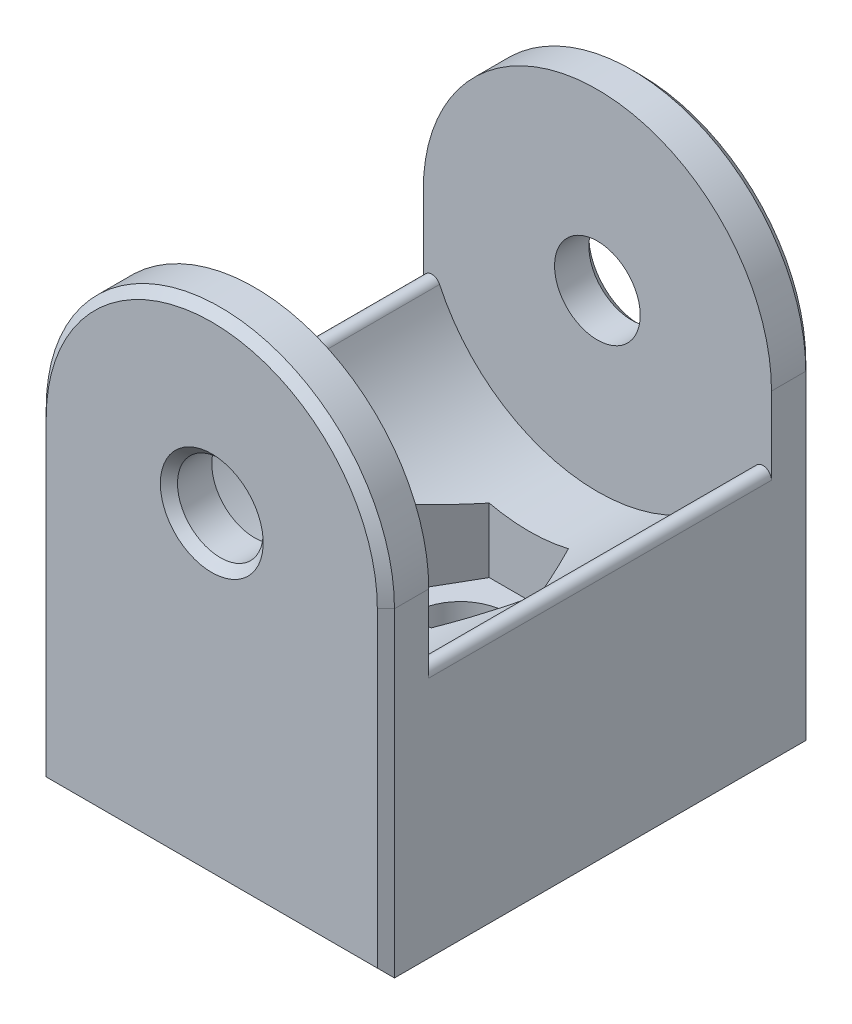
ISO-10303-21;
HEADER;
FILE_DESCRIPTION(('STEP AP214'),'2;1');
FILE_NAME('part.step','',(''),(''),'','','');
FILE_SCHEMA(('AUTOMOTIVE_DESIGN { 1 0 10303 214 1 1 1 1 }'));
ENDSEC;
DATA;
#1=APPLICATION_CONTEXT('core data for automotive mechanical design processes');
#2=APPLICATION_PROTOCOL_DEFINITION('international standard','automotive_design',2000,#1);
#3=PRODUCT_CONTEXT('',#1,'mechanical');
#4=PRODUCT('Part','Part','',(#3));
#5=PRODUCT_RELATED_PRODUCT_CATEGORY('part','',(#4));
#6=PRODUCT_DEFINITION_FORMATION('','',#4);
#7=PRODUCT_DEFINITION_CONTEXT('part definition',#1,'design');
#8=PRODUCT_DEFINITION('design','',#6,#7);
#9=PRODUCT_DEFINITION_SHAPE('','',#8);
#10=(LENGTH_UNIT() NAMED_UNIT(*) SI_UNIT(.MILLI.,.METRE.));
#11=(NAMED_UNIT(*) PLANE_ANGLE_UNIT() SI_UNIT($,.RADIAN.));
#12=(NAMED_UNIT(*) SI_UNIT($,.STERADIAN.) SOLID_ANGLE_UNIT());
#13=UNCERTAINTY_MEASURE_WITH_UNIT(LENGTH_MEASURE(1.E-05),#10,'distance_accuracy_value','');
#14=(GEOMETRIC_REPRESENTATION_CONTEXT(3) GLOBAL_UNCERTAINTY_ASSIGNED_CONTEXT((#13)) GLOBAL_UNIT_ASSIGNED_CONTEXT((#10,
#11,#12)) REPRESENTATION_CONTEXT('',''));
#15=CARTESIAN_POINT('',(0.,0.,0.));
#16=DIRECTION('',(0.,0.,1.));
#17=DIRECTION('',(1.,0.,0.));
#18=AXIS2_PLACEMENT_3D('',#15,#16,#17);
#19=CARTESIAN_POINT('',(0.,18.66,37.588004639698));
#20=DIRECTION('',(0.,0.,-1.));
#21=DIRECTION('',(-1.,0.,0.));
#22=AXIS2_PLACEMENT_3D('',#19,#20,#21);
#23=CYLINDRICAL_SURFACE('',#22,10.16);
#24=CARTESIAN_POINT('',(0.,18.66,10.));
#25=DIRECTION('',(0.,0.,1.));
#26=DIRECTION('',(0.,-1.,0.));
#27=AXIS2_PLACEMENT_3D('',#24,#25,#26);
#28=CIRCLE('',#27,10.16);
#29=CARTESIAN_POINT('',(9.206904315197,14.3636628471677,10.));
#30=VERTEX_POINT('',#29);
#31=CARTESIAN_POINT('',(-9.206904315197,14.3636628471677,10.));
#32=VERTEX_POINT('',#31);
#33=EDGE_CURVE('E226',#30,#32,#28,.F.);
#34=ORIENTED_EDGE('',*,*,#33,.F.);
#35=DIRECTION('',(0.,0.,-1.));
#36=VECTOR('',#35,1.);
#37=CARTESIAN_POINT('',(9.206904315197,14.3636628471677,37.588004639698));
#38=LINE('',#37,#36);
#39=CARTESIAN_POINT('',(9.206904315197,14.3636628471677,-10.));
#40=VERTEX_POINT('',#39);
#41=EDGE_CURVE('E257',#30,#40,#38,.T.);
#42=ORIENTED_EDGE('',*,*,#41,.T.);
#43=CARTESIAN_POINT('',(0.,18.66,-10.));
#44=DIRECTION('',(0.,0.,-1.));
#45=DIRECTION('',(-1.,0.,0.));
#46=AXIS2_PLACEMENT_3D('',#43,#44,#45);
#47=CIRCLE('',#46,10.16);
#48=CARTESIAN_POINT('',(-9.206904315197,14.3636628471677,-10.));
#49=VERTEX_POINT('',#48);
#50=EDGE_CURVE('E185',#40,#49,#47,.T.);
#51=ORIENTED_EDGE('',*,*,#50,.T.);
#52=DIRECTION('',(0.,0.,-1.));
#53=VECTOR('',#52,1.);
#54=CARTESIAN_POINT('',(-9.20690431519699,14.3636628471677,37.588004639698));
#55=LINE('',#54,#53);
#56=EDGE_CURVE('E253',#49,#32,#55,.F.);
#57=ORIENTED_EDGE('',*,*,#56,.T.);
#58=EDGE_LOOP('',(#34,#42,#51,#57));
#59=FACE_BOUND('',#58,.T.);
#60=CARTESIAN_POINT('',(0.,18.66,6.00000000000001));
#61=DIRECTION('',(-0.866025403784439,0.,-0.5));
#62=DIRECTION('',(0.5,0.,-0.866025403784439));
#63=AXIS2_PLACEMENT_3D('',#60,#61,#62);
#64=ELLIPSE('',#63,20.32,10.16);
#65=CARTESIAN_POINT('',(2.30940107675851,8.76594791469811,2.));
#66=VERTEX_POINT('',#65);
#67=CARTESIAN_POINT('',(4.61880215351701,9.61056539519365,-2.));
#68=VERTEX_POINT('',#67);
#69=EDGE_CURVE('E182',#66,#68,#64,.F.);
#70=ORIENTED_EDGE('',*,*,#69,.F.);
#71=CARTESIAN_POINT('',(0.,18.66,2.));
#72=DIRECTION('',(0.,0.,-1.));
#73=DIRECTION('',(-1.,0.,0.));
#74=AXIS2_PLACEMENT_3D('',#71,#72,#73);
#75=CIRCLE('',#74,10.16);
#76=CARTESIAN_POINT('',(-2.30940107675851,8.76594791469811,2.));
#77=VERTEX_POINT('',#76);
#78=EDGE_CURVE('E285',#77,#66,#75,.F.);
#79=ORIENTED_EDGE('',*,*,#78,.F.);
#80=CARTESIAN_POINT('',(0.,18.66,6.));
#81=DIRECTION('',(0.866025403784439,0.,-0.5));
#82=DIRECTION('',(-0.5,0.,-0.866025403784439));
#83=AXIS2_PLACEMENT_3D('',#80,#81,#82);
#84=ELLIPSE('',#83,20.32,10.16);
#85=CARTESIAN_POINT('',(-4.61880215351701,9.61056539519365,-2.));
#86=VERTEX_POINT('',#85);
#87=EDGE_CURVE('E287',#86,#77,#84,.F.);
#88=ORIENTED_EDGE('',*,*,#87,.F.);
#89=CARTESIAN_POINT('',(0.,18.66,-10.));
#90=DIRECTION('',(0.866025403784439,0.,0.5));
#91=DIRECTION('',(0.5,0.,-0.866025403784439));
#92=AXIS2_PLACEMENT_3D('',#89,#90,#91);
#93=ELLIPSE('',#92,20.32,10.16);
#94=CARTESIAN_POINT('',(-2.3094010767585,8.76594791469811,-6.));
#95=VERTEX_POINT('',#94);
#96=EDGE_CURVE('E290',#95,#86,#93,.F.);
#97=ORIENTED_EDGE('',*,*,#96,.F.);
#98=CARTESIAN_POINT('',(0.,18.66,-6.00000000000001));
#99=DIRECTION('',(0.,0.,1.));
#100=DIRECTION('',(1.,0.,0.));
#101=AXIS2_PLACEMENT_3D('',#98,#99,#100);
#102=CIRCLE('',#101,10.16);
#103=CARTESIAN_POINT('',(2.3094010767585,8.76594791469811,-6.00000000000001));
#104=VERTEX_POINT('',#103);
#105=EDGE_CURVE('E292',#104,#95,#102,.F.);
#106=ORIENTED_EDGE('',*,*,#105,.F.);
#107=CARTESIAN_POINT('',(0.,18.66,-10.));
#108=DIRECTION('',(-0.866025403784439,0.,0.5));
#109=DIRECTION('',(-0.5,0.,-0.866025403784439));
#110=AXIS2_PLACEMENT_3D('',#107,#108,#109);
#111=ELLIPSE('',#110,20.32,10.16);
#112=EDGE_CURVE('E294',#68,#104,#111,.F.);
#113=ORIENTED_EDGE('',*,*,#112,.F.);
#114=EDGE_LOOP('',(#70,#79,#88,#97,#106,#113));
#115=FACE_BOUND('',#114,.T.);
#116=ADVANCED_FACE('F35',(#59,#115),#23,.F.);
#117=CARTESIAN_POINT('',(-10.16,28.82,10.));
#118=DIRECTION('',(0.,0.,1.));
#119=DIRECTION('',(0.,-1.,0.));
#120=AXIS2_PLACEMENT_3D('',#117,#118,#119);
#121=PLANE('',#120);
#122=CARTESIAN_POINT('',(0.,18.66,10.));
#123=DIRECTION('',(0.,0.,1.));
#124=DIRECTION('',(0.,-1.,0.));
#125=AXIS2_PLACEMENT_3D('',#122,#123,#124);
#126=CIRCLE('',#125,2.5);
#127=CARTESIAN_POINT('',(0.,16.16,10.));
#128=VERTEX_POINT('',#127);
#129=EDGE_CURVE('E241',#128,#128,#126,.T.);
#130=ORIENTED_EDGE('',*,*,#129,.T.);
#131=EDGE_LOOP('',(#130));
#132=FACE_BOUND('',#131,.T.);
#133=CARTESIAN_POINT('',(0.,18.66,10.));
#134=DIRECTION('',(0.,0.,1.));
#135=DIRECTION('',(0.,-1.,0.));
#136=AXIS2_PLACEMENT_3D('',#133,#134,#135);
#137=CIRCLE('',#136,10.16);
#138=CARTESIAN_POINT('',(-10.16,18.66,10.));
#139=VERTEX_POINT('',#138);
#140=CARTESIAN_POINT('',(10.16,18.66,10.));
#141=VERTEX_POINT('',#140);
#142=EDGE_CURVE('E237',#139,#141,#137,.F.);
#143=ORIENTED_EDGE('',*,*,#142,.T.);
#144=DIRECTION('',(0.,1.,0.));
#145=VECTOR('',#144,1.);
#146=CARTESIAN_POINT('',(10.16,28.82,9.99999999999999));
#147=LINE('',#146,#145);
#148=CARTESIAN_POINT('',(10.16,14.1522289321661,10.));
#149=VERTEX_POINT('',#148);
#150=EDGE_CURVE('E260',#149,#141,#147,.T.);
#151=ORIENTED_EDGE('',*,*,#150,.F.);
#152=CARTESIAN_POINT('',(9.66,14.1522289321661,10.));
#153=DIRECTION('',(0.,0.,1.));
#154=DIRECTION('',(0.,-1.,0.));
#155=AXIS2_PLACEMENT_3D('',#152,#153,#154);
#156=CIRCLE('',#155,0.5);
#157=EDGE_CURVE('E279',#149,#30,#156,.T.);
#158=ORIENTED_EDGE('',*,*,#157,.T.);
#159=ORIENTED_EDGE('',*,*,#33,.T.);
#160=CARTESIAN_POINT('',(-9.66,14.1522289321661,10.));
#161=DIRECTION('',(0.,0.,1.));
#162=DIRECTION('',(0.,-1.,0.));
#163=AXIS2_PLACEMENT_3D('',#160,#161,#162);
#164=CIRCLE('',#163,0.5);
#165=CARTESIAN_POINT('',(-10.16,14.1522289321661,10.));
#166=VERTEX_POINT('',#165);
#167=EDGE_CURVE('E283',#32,#166,#164,.T.);
#168=ORIENTED_EDGE('',*,*,#167,.T.);
#169=DIRECTION('',(0.,-1.,0.));
#170=VECTOR('',#169,1.);
#171=CARTESIAN_POINT('',(-10.16,28.82,10.));
#172=LINE('',#171,#170);
#173=EDGE_CURVE('E268',#139,#166,#172,.T.);
#174=ORIENTED_EDGE('',*,*,#173,.F.);
#175=EDGE_LOOP('',(#143,#151,#158,#159,#168,#174));
#176=FACE_BOUND('',#175,.T.);
#177=ADVANCED_FACE('F375',(#132,#176),#121,.F.);
#178=CARTESIAN_POINT('',(-10.16,28.82,-9.99999999999999));
#179=DIRECTION('',(0.,0.,-1.));
#180=DIRECTION('',(-1.,0.,0.));
#181=AXIS2_PLACEMENT_3D('',#178,#179,#180);
#182=PLANE('',#181);
#183=CARTESIAN_POINT('',(0.,18.66,-10.));
#184=DIRECTION('',(0.,0.,-1.));
#185=DIRECTION('',(-1.,0.,0.));
#186=AXIS2_PLACEMENT_3D('',#183,#184,#185);
#187=CIRCLE('',#186,2.5);
#188=CARTESIAN_POINT('',(-2.5,18.66,-10.));
#189=VERTEX_POINT('',#188);
#190=EDGE_CURVE('E240',#189,#189,#187,.T.);
#191=ORIENTED_EDGE('',*,*,#190,.T.);
#192=EDGE_LOOP('',(#191));
#193=FACE_BOUND('',#192,.T.);
#194=ORIENTED_EDGE('',*,*,#50,.F.);
#195=CARTESIAN_POINT('',(9.66,14.1522289321661,-10.));
#196=DIRECTION('',(0.,0.,-1.));
#197=DIRECTION('',(-1.,0.,0.));
#198=AXIS2_PLACEMENT_3D('',#195,#196,#197);
#199=CIRCLE('',#198,0.5);
#200=CARTESIAN_POINT('',(10.16,14.1522289321661,-10.));
#201=VERTEX_POINT('',#200);
#202=EDGE_CURVE('E277',#40,#201,#199,.T.);
#203=ORIENTED_EDGE('',*,*,#202,.T.);
#204=DIRECTION('',(0.,-1.,0.));
#205=VECTOR('',#204,1.);
#206=CARTESIAN_POINT('',(10.16,28.82,-10.));
#207=LINE('',#206,#205);
#208=CARTESIAN_POINT('',(10.16,18.66,-10.));
#209=VERTEX_POINT('',#208);
#210=EDGE_CURVE('E265',#209,#201,#207,.T.);
#211=ORIENTED_EDGE('',*,*,#210,.F.);
#212=CARTESIAN_POINT('',(0.,18.66,-10.));
#213=DIRECTION('',(0.,0.,-1.));
#214=DIRECTION('',(-1.,0.,0.));
#215=AXIS2_PLACEMENT_3D('',#212,#213,#214);
#216=CIRCLE('',#215,10.16);
#217=CARTESIAN_POINT('',(-10.16,18.66,-9.99999999999999));
#218=VERTEX_POINT('',#217);
#219=EDGE_CURVE('E250',#209,#218,#216,.F.);
#220=ORIENTED_EDGE('',*,*,#219,.T.);
#221=DIRECTION('',(0.,1.,0.));
#222=VECTOR('',#221,1.);
#223=CARTESIAN_POINT('',(-10.16,28.82,-9.99999999999999));
#224=LINE('',#223,#222);
#225=CARTESIAN_POINT('',(-10.16,14.1522289321661,-10.));
#226=VERTEX_POINT('',#225);
#227=EDGE_CURVE('E274',#226,#218,#224,.T.);
#228=ORIENTED_EDGE('',*,*,#227,.F.);
#229=CARTESIAN_POINT('',(-9.66,14.1522289321661,-9.99999999999999));
#230=DIRECTION('',(0.,0.,-1.));
#231=DIRECTION('',(-1.,0.,0.));
#232=AXIS2_PLACEMENT_3D('',#229,#230,#231);
#233=CIRCLE('',#232,0.5);
#234=EDGE_CURVE('E281',#226,#49,#233,.T.);
#235=ORIENTED_EDGE('',*,*,#234,.T.);
#236=EDGE_LOOP('',(#194,#203,#211,#220,#228,#235));
#237=FACE_BOUND('',#236,.T.);
#238=ADVANCED_FACE('F431',(#193,#237),#182,.F.);
#239=CARTESIAN_POINT('',(10.16,28.82,-12.5));
#240=DIRECTION('',(-1.,0.,0.));
#241=DIRECTION('',(0.,0.,1.));
#242=AXIS2_PLACEMENT_3D('',#239,#240,#241);
#243=PLANE('',#242);
#244=DIRECTION('',(0.,0.,-1.));
#245=VECTOR('',#244,1.);
#246=CARTESIAN_POINT('',(10.16,0.,-12.5));
#247=LINE('',#246,#245);
#248=CARTESIAN_POINT('',(10.16,0.,12.));
#249=VERTEX_POINT('',#248);
#250=CARTESIAN_POINT('',(10.16,0.,-12.));
#251=VERTEX_POINT('',#250);
#252=EDGE_CURVE('E244',#249,#251,#247,.T.);
#253=ORIENTED_EDGE('',*,*,#252,.T.);
#254=DIRECTION('',(0.,1.,0.));
#255=VECTOR('',#254,1.);
#256=CARTESIAN_POINT('',(10.16,28.82,-12.));
#257=LINE('',#256,#255);
#258=CARTESIAN_POINT('',(10.16,18.66,-12.));
#259=VERTEX_POINT('',#258);
#260=EDGE_CURVE('E317',#251,#259,#257,.T.);
#261=ORIENTED_EDGE('',*,*,#260,.T.);
#262=DIRECTION('',(0.,0.,1.));
#263=VECTOR('',#262,1.);
#264=CARTESIAN_POINT('',(10.16,18.66,-16.32));
#265=LINE('',#264,#263);
#266=EDGE_CURVE('E234',#259,#209,#265,.T.);
#267=ORIENTED_EDGE('',*,*,#266,.T.);
#268=ORIENTED_EDGE('',*,*,#210,.T.);
#269=DIRECTION('',(0.,0.,-1.));
#270=VECTOR('',#269,1.);
#271=CARTESIAN_POINT('',(10.16,14.1522289321661,-12.5));
#272=LINE('',#271,#270);
#273=EDGE_CURVE('E262',#201,#149,#272,.F.);
#274=ORIENTED_EDGE('',*,*,#273,.T.);
#275=ORIENTED_EDGE('',*,*,#150,.T.);
#276=CARTESIAN_POINT('',(10.16,18.66,12.));
#277=VERTEX_POINT('',#276);
#278=EDGE_CURVE('E229',#141,#277,#265,.T.);
#279=ORIENTED_EDGE('',*,*,#278,.T.);
#280=DIRECTION('',(0.,-1.,0.));
#281=VECTOR('',#280,1.);
#282=CARTESIAN_POINT('',(10.16,28.82,12.));
#283=LINE('',#282,#281);
#284=EDGE_CURVE('E315',#277,#249,#283,.T.);
#285=ORIENTED_EDGE('',*,*,#284,.T.);
#286=EDGE_LOOP('',(#253,#261,#267,#268,#274,#275,#279,#285));
#287=FACE_BOUND('',#286,.T.);
#288=ADVANCED_FACE('F370',(#287),#243,.F.);
#289=CARTESIAN_POINT('',(-10.16,28.82,-12.5));
#290=DIRECTION('',(0.,0.,1.));
#291=DIRECTION('',(1.,0.,0.));
#292=AXIS2_PLACEMENT_3D('',#289,#290,#291);
#293=PLANE('',#292);
#294=DIRECTION('',(0.,-1.,0.));
#295=VECTOR('',#294,1.);
#296=CARTESIAN_POINT('',(9.65999999999999,28.82,-12.5));
#297=LINE('',#296,#295);
#298=CARTESIAN_POINT('',(9.66,18.66,-12.5));
#299=VERTEX_POINT('',#298);
#300=CARTESIAN_POINT('',(9.65999999999999,0.500000000000004,-12.5));
#301=VERTEX_POINT('',#300);
#302=EDGE_CURVE('E304',#299,#301,#297,.T.);
#303=ORIENTED_EDGE('',*,*,#302,.T.);
#304=DIRECTION('',(-1.,0.,0.));
#305=VECTOR('',#304,1.);
#306=CARTESIAN_POINT('',(-10.16,0.500000000000004,-12.5));
#307=LINE('',#306,#305);
#308=CARTESIAN_POINT('',(-9.66,0.500000000000004,-12.5));
#309=VERTEX_POINT('',#308);
#310=EDGE_CURVE('E306',#301,#309,#307,.T.);
#311=ORIENTED_EDGE('',*,*,#310,.T.);
#312=DIRECTION('',(0.,1.,0.));
#313=VECTOR('',#312,1.);
#314=CARTESIAN_POINT('',(-9.66,28.82,-12.5));
#315=LINE('',#314,#313);
#316=CARTESIAN_POINT('',(-9.66,18.66,-12.5));
#317=VERTEX_POINT('',#316);
#318=EDGE_CURVE('E300',#309,#317,#315,.T.);
#319=ORIENTED_EDGE('',*,*,#318,.T.);
#320=CARTESIAN_POINT('',(0.,18.66,-12.5));
#321=DIRECTION('',(0.,0.,1.));
#322=DIRECTION('',(1.,0.,0.));
#323=AXIS2_PLACEMENT_3D('',#320,#321,#322);
#324=CIRCLE('',#323,9.66);
#325=EDGE_CURVE('E302',#317,#299,#324,.F.);
#326=ORIENTED_EDGE('',*,*,#325,.T.);
#327=EDGE_LOOP('',(#303,#311,#319,#326));
#328=FACE_BOUND('',#327,.T.);
#329=CARTESIAN_POINT('',(0.,18.66,-12.5));
#330=DIRECTION('',(0.,0.,1.));
#331=DIRECTION('',(1.,0.,0.));
#332=AXIS2_PLACEMENT_3D('',#329,#330,#331);
#333=CIRCLE('',#332,3.);
#334=CARTESIAN_POINT('',(3.,18.66,-12.5));
#335=VERTEX_POINT('',#334);
#336=EDGE_CURVE('E297',#335,#335,#333,.T.);
#337=ORIENTED_EDGE('',*,*,#336,.T.);
#338=EDGE_LOOP('',(#337));
#339=FACE_BOUND('',#338,.T.);
#340=ADVANCED_FACE('F400',(#328,#339),#293,.F.);
#341=CARTESIAN_POINT('',(-10.16,28.82,-12.5));
#342=DIRECTION('',(1.,0.,0.));
#343=DIRECTION('',(0.,0.,-1.));
#344=AXIS2_PLACEMENT_3D('',#341,#342,#343);
#345=PLANE('',#344);
#346=DIRECTION('',(0.,0.,1.));
#347=VECTOR('',#346,1.);
#348=CARTESIAN_POINT('',(-10.16,18.66,-16.32));
#349=LINE('',#348,#347);
#350=CARTESIAN_POINT('',(-10.16,18.66,-12.));
#351=VERTEX_POINT('',#350);
#352=EDGE_CURVE('E233',#351,#218,#349,.T.);
#353=ORIENTED_EDGE('',*,*,#352,.F.);
#354=DIRECTION('',(0.,-1.,0.));
#355=VECTOR('',#354,1.);
#356=CARTESIAN_POINT('',(-10.16,28.82,-12.));
#357=LINE('',#356,#355);
#358=CARTESIAN_POINT('',(-10.16,0.,-12.));
#359=VERTEX_POINT('',#358);
#360=EDGE_CURVE('E323',#351,#359,#357,.T.);
#361=ORIENTED_EDGE('',*,*,#360,.T.);
#362=DIRECTION('',(0.,0.,1.));
#363=VECTOR('',#362,1.);
#364=CARTESIAN_POINT('',(-10.16,0.,-12.5));
#365=LINE('',#364,#363);
#366=CARTESIAN_POINT('',(-10.16,0.,12.));
#367=VERTEX_POINT('',#366);
#368=EDGE_CURVE('E247',#359,#367,#365,.T.);
#369=ORIENTED_EDGE('',*,*,#368,.T.);
#370=DIRECTION('',(0.,1.,0.));
#371=VECTOR('',#370,1.);
#372=CARTESIAN_POINT('',(-10.16,28.82,12.));
#373=LINE('',#372,#371);
#374=CARTESIAN_POINT('',(-10.16,18.66,12.));
#375=VERTEX_POINT('',#374);
#376=EDGE_CURVE('E321',#367,#375,#373,.T.);
#377=ORIENTED_EDGE('',*,*,#376,.T.);
#378=EDGE_CURVE('E230',#139,#375,#349,.T.);
#379=ORIENTED_EDGE('',*,*,#378,.F.);
#380=ORIENTED_EDGE('',*,*,#173,.T.);
#381=DIRECTION('',(0.,0.,-1.));
#382=VECTOR('',#381,1.);
#383=CARTESIAN_POINT('',(-10.16,14.1522289321661,-12.5));
#384=LINE('',#383,#382);
#385=EDGE_CURVE('E271',#166,#226,#384,.T.);
#386=ORIENTED_EDGE('',*,*,#385,.T.);
#387=ORIENTED_EDGE('',*,*,#227,.T.);
#388=EDGE_LOOP('',(#353,#361,#369,#377,#379,#380,#386,#387));
#389=FACE_BOUND('',#388,.T.);
#390=ADVANCED_FACE('F381',(#389),#345,.F.);
#391=CARTESIAN_POINT('',(-10.16,28.82,12.5));
#392=DIRECTION('',(0.,0.,-1.));
#393=DIRECTION('',(-1.,0.,0.));
#394=AXIS2_PLACEMENT_3D('',#391,#392,#393);
#395=PLANE('',#394);
#396=DIRECTION('',(0.,-1.,0.));
#397=VECTOR('',#396,1.);
#398=CARTESIAN_POINT('',(-9.66,28.82,12.5));
#399=LINE('',#398,#397);
#400=CARTESIAN_POINT('',(-9.66,18.66,12.5));
#401=VERTEX_POINT('',#400);
#402=CARTESIAN_POINT('',(-9.66,0.5,12.5));
#403=VERTEX_POINT('',#402);
#404=EDGE_CURVE('E52',#401,#403,#399,.T.);
#405=ORIENTED_EDGE('',*,*,#404,.T.);
#406=DIRECTION('',(1.,0.,0.));
#407=VECTOR('',#406,1.);
#408=CARTESIAN_POINT('',(-10.16,0.5,12.5));
#409=LINE('',#408,#407);
#410=CARTESIAN_POINT('',(9.66,0.5,12.5));
#411=VERTEX_POINT('',#410);
#412=EDGE_CURVE('E335',#403,#411,#409,.T.);
#413=ORIENTED_EDGE('',*,*,#412,.T.);
#414=DIRECTION('',(0.,1.,0.));
#415=VECTOR('',#414,1.);
#416=CARTESIAN_POINT('',(9.66,28.82,12.5));
#417=LINE('',#416,#415);
#418=CARTESIAN_POINT('',(9.66,18.66,12.5));
#419=VERTEX_POINT('',#418);
#420=EDGE_CURVE('E331',#411,#419,#417,.T.);
#421=ORIENTED_EDGE('',*,*,#420,.T.);
#422=CARTESIAN_POINT('',(0.,18.66,12.5));
#423=DIRECTION('',(0.,0.,-1.));
#424=DIRECTION('',(-1.,0.,0.));
#425=AXIS2_PLACEMENT_3D('',#422,#423,#424);
#426=CIRCLE('',#425,9.66);
#427=EDGE_CURVE('E57',#419,#401,#426,.F.);
#428=ORIENTED_EDGE('',*,*,#427,.T.);
#429=EDGE_LOOP('',(#405,#413,#421,#428));
#430=FACE_BOUND('',#429,.T.);
#431=CARTESIAN_POINT('',(0.,18.66,12.5));
#432=DIRECTION('',(0.,0.,-1.));
#433=DIRECTION('',(-1.,0.,0.));
#434=AXIS2_PLACEMENT_3D('',#431,#432,#433);
#435=CIRCLE('',#434,3.);
#436=CARTESIAN_POINT('',(-3.,18.66,12.5));
#437=VERTEX_POINT('',#436);
#438=EDGE_CURVE('E328',#437,#437,#435,.T.);
#439=ORIENTED_EDGE('',*,*,#438,.T.);
#440=EDGE_LOOP('',(#439));
#441=FACE_BOUND('',#440,.T.);
#442=ADVANCED_FACE('F450',(#430,#441),#395,.F.);
#443=CARTESIAN_POINT('',(0.,0.,0.));
#444=DIRECTION('',(0.,1.,0.));
#445=DIRECTION('',(0.,0.,1.));
#446=AXIS2_PLACEMENT_3D('',#443,#444,#445);
#447=PLANE('',#446);
#448=CARTESIAN_POINT('',(0.,0.,-2.));
#449=DIRECTION('',(0.,1.,0.));
#450=DIRECTION('',(0.,0.,1.));
#451=AXIS2_PLACEMENT_3D('',#448,#449,#450);
#452=CIRCLE('',#451,2.75);
#453=CARTESIAN_POINT('',(0.,0.,0.749999999999999));
#454=VERTEX_POINT('',#453);
#455=EDGE_CURVE('E201',#454,#454,#452,.T.);
#456=ORIENTED_EDGE('',*,*,#455,.T.);
#457=EDGE_LOOP('',(#456));
#458=FACE_BOUND('',#457,.T.);
#459=ORIENTED_EDGE('',*,*,#368,.F.);
#460=DIRECTION('',(1.,0.,0.));
#461=VECTOR('',#460,1.);
#462=CARTESIAN_POINT('',(0.,0.,-12.));
#463=LINE('',#462,#461);
#464=EDGE_CURVE('E312',#359,#251,#463,.T.);
#465=ORIENTED_EDGE('',*,*,#464,.T.);
#466=ORIENTED_EDGE('',*,*,#252,.F.);
#467=DIRECTION('',(-1.,0.,0.));
#468=VECTOR('',#467,1.);
#469=CARTESIAN_POINT('',(0.,0.,12.));
#470=LINE('',#469,#468);
#471=EDGE_CURVE('E309',#249,#367,#470,.T.);
#472=ORIENTED_EDGE('',*,*,#471,.T.);
#473=EDGE_LOOP('',(#459,#465,#466,#472));
#474=FACE_BOUND('',#473,.T.);
#475=ADVANCED_FACE('F386',(#458,#474),#447,.F.);
#476=CARTESIAN_POINT('',(0.,18.66,-16.32));
#477=DIRECTION('',(0.,0.,1.));
#478=DIRECTION('',(1.,0.,0.));
#479=AXIS2_PLACEMENT_3D('',#476,#477,#478);
#480=CYLINDRICAL_SURFACE('',#479,10.16);
#481=ORIENTED_EDGE('',*,*,#266,.F.);
#482=CARTESIAN_POINT('',(0.,18.66,-12.));
#483=DIRECTION('',(0.,0.,1.));
#484=DIRECTION('',(1.,0.,0.));
#485=AXIS2_PLACEMENT_3D('',#482,#483,#484);
#486=CIRCLE('',#485,10.16);
#487=EDGE_CURVE('E319',#259,#351,#486,.T.);
#488=ORIENTED_EDGE('',*,*,#487,.T.);
#489=ORIENTED_EDGE('',*,*,#352,.T.);
#490=ORIENTED_EDGE('',*,*,#219,.F.);
#491=EDGE_LOOP('',(#481,#488,#489,#490));
#492=FACE_BOUND('',#491,.T.);
#493=ADVANCED_FACE('F411',(#492),#480,.T.);
#494=CARTESIAN_POINT('',(0.,18.66,-16.32));
#495=DIRECTION('',(0.,0.,1.));
#496=DIRECTION('',(1.,0.,0.));
#497=AXIS2_PLACEMENT_3D('',#494,#495,#496);
#498=CYLINDRICAL_SURFACE('',#497,2.5);
#499=CARTESIAN_POINT('',(0.,18.66,-12.));
#500=DIRECTION('',(0.,0.,1.));
#501=DIRECTION('',(1.,0.,0.));
#502=AXIS2_PLACEMENT_3D('',#499,#500,#501);
#503=CIRCLE('',#502,2.5);
#504=CARTESIAN_POINT('',(2.5,18.66,-12.));
#505=VERTEX_POINT('',#504);
#506=EDGE_CURVE('E325',#505,#505,#503,.F.);
#507=ORIENTED_EDGE('',*,*,#506,.T.);
#508=EDGE_LOOP('',(#507));
#509=FACE_BOUND('',#508,.T.);
#510=ORIENTED_EDGE('',*,*,#190,.F.);
#511=EDGE_LOOP('',(#510));
#512=FACE_BOUND('',#511,.T.);
#513=ADVANCED_FACE('F438',(#509,#512),#498,.F.);
#514=ORIENTED_EDGE('',*,*,#378,.T.);
#515=CARTESIAN_POINT('',(0.,18.66,12.));
#516=DIRECTION('',(0.,0.,-1.));
#517=DIRECTION('',(-1.,0.,0.));
#518=AXIS2_PLACEMENT_3D('',#515,#516,#517);
#519=CIRCLE('',#518,10.16);
#520=EDGE_CURVE('E44',#375,#277,#519,.T.);
#521=ORIENTED_EDGE('',*,*,#520,.T.);
#522=ORIENTED_EDGE('',*,*,#278,.F.);
#523=ORIENTED_EDGE('',*,*,#142,.F.);
#524=EDGE_LOOP('',(#514,#521,#522,#523));
#525=FACE_BOUND('',#524,.T.);
#526=ADVANCED_FACE('F366',(#525),#480,.T.);
#527=CARTESIAN_POINT('',(0.,18.66,12.));
#528=DIRECTION('',(0.,0.,-1.));
#529=DIRECTION('',(-1.,0.,0.));
#530=AXIS2_PLACEMENT_3D('',#527,#528,#529);
#531=CIRCLE('',#530,2.5);
#532=CARTESIAN_POINT('',(-2.5,18.66,12.));
#533=VERTEX_POINT('',#532);
#534=EDGE_CURVE('E11',#533,#533,#531,.F.);
#535=ORIENTED_EDGE('',*,*,#534,.T.);
#536=EDGE_LOOP('',(#535));
#537=FACE_BOUND('',#536,.T.);
#538=ORIENTED_EDGE('',*,*,#129,.F.);
#539=EDGE_LOOP('',(#538));
#540=FACE_BOUND('',#539,.T.);
#541=ADVANCED_FACE('F442',(#537,#540),#498,.F.);
#542=CARTESIAN_POINT('',(9.66,14.1522289321661,37.588004639698));
#543=DIRECTION('',(0.,0.,-1.));
#544=DIRECTION('',(-1.,0.,0.));
#545=AXIS2_PLACEMENT_3D('',#542,#543,#544);
#546=CYLINDRICAL_SURFACE('',#545,0.5);
#547=ORIENTED_EDGE('',*,*,#157,.F.);
#548=ORIENTED_EDGE('',*,*,#273,.F.);
#549=ORIENTED_EDGE('',*,*,#202,.F.);
#550=ORIENTED_EDGE('',*,*,#41,.F.);
#551=EDGE_LOOP('',(#547,#548,#549,#550));
#552=FACE_BOUND('',#551,.T.);
#553=ADVANCED_FACE('F460',(#552),#546,.T.);
#554=CARTESIAN_POINT('',(-9.66,14.1522289321661,37.588004639698));
#555=DIRECTION('',(0.,0.,-1.));
#556=DIRECTION('',(-1.,0.,0.));
#557=AXIS2_PLACEMENT_3D('',#554,#555,#556);
#558=CYLINDRICAL_SURFACE('',#557,0.5);
#559=ORIENTED_EDGE('',*,*,#167,.F.);
#560=ORIENTED_EDGE('',*,*,#56,.F.);
#561=ORIENTED_EDGE('',*,*,#234,.F.);
#562=ORIENTED_EDGE('',*,*,#385,.F.);
#563=EDGE_LOOP('',(#559,#560,#561,#562));
#564=FACE_BOUND('',#563,.T.);
#565=ADVANCED_FACE('F463',(#564),#558,.T.);
#566=CARTESIAN_POINT('',(2.30940107675851,28.82,2.));
#567=DIRECTION('',(-0.866025403784439,0.,-0.5));
#568=DIRECTION('',(-0.5,0.,0.866025403784439));
#569=AXIS2_PLACEMENT_3D('',#566,#567,#568);
#570=PLANE('',#569);
#571=ORIENTED_EDGE('',*,*,#69,.T.);
#572=DIRECTION('',(0.,-1.,0.));
#573=VECTOR('',#572,1.);
#574=CARTESIAN_POINT('',(4.61880215351701,28.82,-2.));
#575=LINE('',#574,#573);
#576=CARTESIAN_POINT('',(4.61880215351701,5.,-2.));
#577=VERTEX_POINT('',#576);
#578=EDGE_CURVE('E174',#68,#577,#575,.T.);
#579=ORIENTED_EDGE('',*,*,#578,.T.);
#580=DIRECTION('',(0.5,0.,-0.866025403784439));
#581=VECTOR('',#580,1.);
#582=CARTESIAN_POINT('',(2.30940107675851,5.,2.));
#583=LINE('',#582,#581);
#584=CARTESIAN_POINT('',(2.30940107675851,5.,2.));
#585=VERTEX_POINT('',#584);
#586=EDGE_CURVE('E179',#585,#577,#583,.T.);
#587=ORIENTED_EDGE('',*,*,#586,.F.);
#588=DIRECTION('',(0.,-1.,0.));
#589=VECTOR('',#588,1.);
#590=CARTESIAN_POINT('',(2.30940107675851,28.82,2.));
#591=LINE('',#590,#589);
#592=EDGE_CURVE('E215',#66,#585,#591,.T.);
#593=ORIENTED_EDGE('',*,*,#592,.F.);
#594=EDGE_LOOP('',(#571,#579,#587,#593));
#595=FACE_BOUND('',#594,.T.);
#596=ADVANCED_FACE('F176',(#595),#570,.T.);
#597=CARTESIAN_POINT('',(4.61880215351701,28.82,-2.));
#598=DIRECTION('',(-0.866025403784439,0.,0.5));
#599=DIRECTION('',(0.5,0.,0.866025403784439));
#600=AXIS2_PLACEMENT_3D('',#597,#598,#599);
#601=PLANE('',#600);
#602=ORIENTED_EDGE('',*,*,#112,.T.);
#603=DIRECTION('',(0.,-1.,0.));
#604=VECTOR('',#603,1.);
#605=CARTESIAN_POINT('',(2.3094010767585,28.82,-6.));
#606=LINE('',#605,#604);
#607=CARTESIAN_POINT('',(2.3094010767585,5.,-6.));
#608=VERTEX_POINT('',#607);
#609=EDGE_CURVE('E186',#104,#608,#606,.T.);
#610=ORIENTED_EDGE('',*,*,#609,.T.);
#611=DIRECTION('',(-0.5,0.,-0.866025403784439));
#612=VECTOR('',#611,1.);
#613=CARTESIAN_POINT('',(4.61880215351701,5.,-2.));
#614=LINE('',#613,#612);
#615=EDGE_CURVE('E189',#577,#608,#614,.T.);
#616=ORIENTED_EDGE('',*,*,#615,.F.);
#617=ORIENTED_EDGE('',*,*,#578,.F.);
#618=EDGE_LOOP('',(#602,#610,#616,#617));
#619=FACE_BOUND('',#618,.T.);
#620=ADVANCED_FACE('F190',(#619),#601,.T.);
#621=CARTESIAN_POINT('',(2.3094010767585,28.82,-6.));
#622=DIRECTION('',(0.,0.,1.));
#623=DIRECTION('',(1.,0.,0.));
#624=AXIS2_PLACEMENT_3D('',#621,#622,#623);
#625=PLANE('',#624);
#626=ORIENTED_EDGE('',*,*,#105,.T.);
#627=DIRECTION('',(0.,-1.,0.));
#628=VECTOR('',#627,1.);
#629=CARTESIAN_POINT('',(-2.3094010767585,28.82,-6.));
#630=LINE('',#629,#628);
#631=CARTESIAN_POINT('',(-2.3094010767585,5.,-6.));
#632=VERTEX_POINT('',#631);
#633=EDGE_CURVE('E221',#95,#632,#630,.T.);
#634=ORIENTED_EDGE('',*,*,#633,.T.);
#635=DIRECTION('',(-1.,0.,0.));
#636=VECTOR('',#635,1.);
#637=CARTESIAN_POINT('',(2.3094010767585,5.,-6.));
#638=LINE('',#637,#636);
#639=EDGE_CURVE('E195',#608,#632,#638,.T.);
#640=ORIENTED_EDGE('',*,*,#639,.F.);
#641=ORIENTED_EDGE('',*,*,#609,.F.);
#642=EDGE_LOOP('',(#626,#634,#640,#641));
#643=FACE_BOUND('',#642,.T.);
#644=ADVANCED_FACE('F584',(#643),#625,.T.);
#645=CARTESIAN_POINT('',(-2.3094010767585,28.82,-6.));
#646=DIRECTION('',(0.866025403784439,0.,0.5));
#647=DIRECTION('',(0.5,0.,-0.866025403784439));
#648=AXIS2_PLACEMENT_3D('',#645,#646,#647);
#649=PLANE('',#648);
#650=ORIENTED_EDGE('',*,*,#96,.T.);
#651=DIRECTION('',(0.,-1.,0.));
#652=VECTOR('',#651,1.);
#653=CARTESIAN_POINT('',(-4.61880215351701,28.82,-2.));
#654=LINE('',#653,#652);
#655=CARTESIAN_POINT('',(-4.61880215351701,5.,-2.));
#656=VERTEX_POINT('',#655);
#657=EDGE_CURVE('E219',#86,#656,#654,.T.);
#658=ORIENTED_EDGE('',*,*,#657,.T.);
#659=DIRECTION('',(-0.5,0.,0.866025403784439));
#660=VECTOR('',#659,1.);
#661=CARTESIAN_POINT('',(-2.3094010767585,5.,-6.));
#662=LINE('',#661,#660);
#663=EDGE_CURVE('E209',#632,#656,#662,.T.);
#664=ORIENTED_EDGE('',*,*,#663,.F.);
#665=ORIENTED_EDGE('',*,*,#633,.F.);
#666=EDGE_LOOP('',(#650,#658,#664,#665));
#667=FACE_BOUND('',#666,.T.);
#668=ADVANCED_FACE('F575',(#667),#649,.T.);
#669=CARTESIAN_POINT('',(-4.61880215351701,28.82,-2.));
#670=DIRECTION('',(0.866025403784439,0.,-0.5));
#671=DIRECTION('',(-0.5,0.,-0.866025403784439));
#672=AXIS2_PLACEMENT_3D('',#669,#670,#671);
#673=PLANE('',#672);
#674=ORIENTED_EDGE('',*,*,#87,.T.);
#675=DIRECTION('',(0.,-1.,0.));
#676=VECTOR('',#675,1.);
#677=CARTESIAN_POINT('',(-2.30940107675851,28.82,2.));
#678=LINE('',#677,#676);
#679=CARTESIAN_POINT('',(-2.30940107675851,5.,2.));
#680=VERTEX_POINT('',#679);
#681=EDGE_CURVE('E217',#77,#680,#678,.T.);
#682=ORIENTED_EDGE('',*,*,#681,.T.);
#683=DIRECTION('',(0.5,0.,0.866025403784439));
#684=VECTOR('',#683,1.);
#685=CARTESIAN_POINT('',(-4.61880215351701,5.,-2.));
#686=LINE('',#685,#684);
#687=EDGE_CURVE('E212',#656,#680,#686,.T.);
#688=ORIENTED_EDGE('',*,*,#687,.F.);
#689=ORIENTED_EDGE('',*,*,#657,.F.);
#690=EDGE_LOOP('',(#674,#682,#688,#689));
#691=FACE_BOUND('',#690,.T.);
#692=ADVANCED_FACE('F566',(#691),#673,.T.);
#693=CARTESIAN_POINT('',(-2.30940107675851,28.82,2.));
#694=DIRECTION('',(0.,0.,-1.));
#695=DIRECTION('',(-1.,0.,0.));
#696=AXIS2_PLACEMENT_3D('',#693,#694,#695);
#697=PLANE('',#696);
#698=ORIENTED_EDGE('',*,*,#78,.T.);
#699=ORIENTED_EDGE('',*,*,#592,.T.);
#700=DIRECTION('',(1.,0.,0.));
#701=VECTOR('',#700,1.);
#702=CARTESIAN_POINT('',(-2.30940107675851,5.,2.));
#703=LINE('',#702,#701);
#704=EDGE_CURVE('E200',#680,#585,#703,.T.);
#705=ORIENTED_EDGE('',*,*,#704,.F.);
#706=ORIENTED_EDGE('',*,*,#681,.F.);
#707=EDGE_LOOP('',(#698,#699,#705,#706));
#708=FACE_BOUND('',#707,.T.);
#709=ADVANCED_FACE('F557',(#708),#697,.T.);
#710=CARTESIAN_POINT('',(0.,5.,0.));
#711=DIRECTION('',(0.,1.,0.));
#712=DIRECTION('',(0.,0.,1.));
#713=AXIS2_PLACEMENT_3D('',#710,#711,#712);
#714=PLANE('',#713);
#715=CARTESIAN_POINT('',(0.,5.,-2.));
#716=DIRECTION('',(0.,1.,0.));
#717=DIRECTION('',(0.,0.,1.));
#718=AXIS2_PLACEMENT_3D('',#715,#716,#717);
#719=CIRCLE('',#718,2.75);
#720=CARTESIAN_POINT('',(0.,5.,0.749999999999999));
#721=VERTEX_POINT('',#720);
#722=EDGE_CURVE('E204',#721,#721,#719,.T.);
#723=ORIENTED_EDGE('',*,*,#722,.F.);
#724=EDGE_LOOP('',(#723));
#725=FACE_BOUND('',#724,.T.);
#726=ORIENTED_EDGE('',*,*,#586,.T.);
#727=ORIENTED_EDGE('',*,*,#615,.T.);
#728=ORIENTED_EDGE('',*,*,#639,.T.);
#729=ORIENTED_EDGE('',*,*,#663,.T.);
#730=ORIENTED_EDGE('',*,*,#687,.T.);
#731=ORIENTED_EDGE('',*,*,#704,.T.);
#732=EDGE_LOOP('',(#726,#727,#728,#729,#730,#731));
#733=FACE_BOUND('',#732,.T.);
#734=ADVANCED_FACE('F197',(#725,#733),#714,.T.);
#735=CARTESIAN_POINT('',(0.,0.,-2.));
#736=DIRECTION('',(0.,1.,0.));
#737=DIRECTION('',(0.,0.,1.));
#738=AXIS2_PLACEMENT_3D('',#735,#736,#737);
#739=CYLINDRICAL_SURFACE('',#738,2.75);
#740=ORIENTED_EDGE('',*,*,#455,.F.);
#741=EDGE_LOOP('',(#740));
#742=FACE_BOUND('',#741,.T.);
#743=ORIENTED_EDGE('',*,*,#722,.T.);
#744=EDGE_LOOP('',(#743));
#745=FACE_BOUND('',#744,.T.);
#746=ADVANCED_FACE('F415',(#742,#745),#739,.F.);
#747=CARTESIAN_POINT('',(0.,18.66,-12.5));
#748=DIRECTION('',(0.,0.,1.));
#749=DIRECTION('',(1.,0.,0.));
#750=AXIS2_PLACEMENT_3D('',#747,#748,#749);
#751=CONICAL_SURFACE('',#750,9.66,0.785398163397452);
#752=DIRECTION('',(0.70710678118655,0.,-0.707106781186545));
#753=VECTOR('',#752,1.);
#754=CARTESIAN_POINT('',(-10.16,18.66,-12.));
#755=LINE('',#754,#753);
#756=EDGE_CURVE('E342',#351,#317,#755,.T.);
#757=ORIENTED_EDGE('',*,*,#756,.F.);
#758=ORIENTED_EDGE('',*,*,#487,.F.);
#759=DIRECTION('',(0.70710678118655,0.,0.707106781186545));
#760=VECTOR('',#759,1.);
#761=CARTESIAN_POINT('',(9.66,18.66,-12.5));
#762=LINE('',#761,#760);
#763=EDGE_CURVE('E345',#299,#259,#762,.T.);
#764=ORIENTED_EDGE('',*,*,#763,.F.);
#765=ORIENTED_EDGE('',*,*,#325,.F.);
#766=EDGE_LOOP('',(#757,#758,#764,#765));
#767=FACE_BOUND('',#766,.T.);
#768=ADVANCED_FACE('F413',(#767),#751,.T.);
#769=CARTESIAN_POINT('',(9.65999999999999,28.82,-12.5));
#770=DIRECTION('',(-0.707106781186545,0.,0.70710678118655));
#771=DIRECTION('',(0.,-1.,0.));
#772=AXIS2_PLACEMENT_3D('',#769,#770,#771);
#773=PLANE('',#772);
#774=ORIENTED_EDGE('',*,*,#763,.T.);
#775=ORIENTED_EDGE('',*,*,#260,.F.);
#776=DIRECTION('',(-0.577350269189627,0.577350269189627,-0.577350269189623));
#777=VECTOR('',#776,1.);
#778=CARTESIAN_POINT('',(0.219999999999951,9.94000000000005,-21.94));
#779=LINE('',#778,#777);
#780=EDGE_CURVE('E340',#301,#251,#779,.F.);
#781=ORIENTED_EDGE('',*,*,#780,.F.);
#782=ORIENTED_EDGE('',*,*,#302,.F.);
#783=EDGE_LOOP('',(#774,#775,#781,#782));
#784=FACE_BOUND('',#783,.T.);
#785=ADVANCED_FACE('F405',(#784),#773,.F.);
#786=CARTESIAN_POINT('',(-10.16,28.82,-12.));
#787=DIRECTION('',(0.707106781186545,0.,0.70710678118655));
#788=DIRECTION('',(0.,-1.,0.));
#789=AXIS2_PLACEMENT_3D('',#786,#787,#788);
#790=PLANE('',#789);
#791=ORIENTED_EDGE('',*,*,#756,.T.);
#792=ORIENTED_EDGE('',*,*,#318,.F.);
#793=DIRECTION('',(-0.577350269189627,-0.577350269189627,0.577350269189623));
#794=VECTOR('',#793,1.);
#795=CARTESIAN_POINT('',(-0.553333333333295,9.60666666666672,-21.6066666666666));
#796=LINE('',#795,#794);
#797=EDGE_CURVE('E338',#359,#309,#796,.F.);
#798=ORIENTED_EDGE('',*,*,#797,.F.);
#799=ORIENTED_EDGE('',*,*,#360,.F.);
#800=EDGE_LOOP('',(#791,#792,#798,#799));
#801=FACE_BOUND('',#800,.T.);
#802=ADVANCED_FACE('F396',(#801),#790,.F.);
#803=CARTESIAN_POINT('',(-10.16,0.500000000000004,-12.5));
#804=DIRECTION('',(0.,0.707106781186545,0.70710678118655));
#805=DIRECTION('',(-1.,0.,0.));
#806=AXIS2_PLACEMENT_3D('',#803,#804,#805);
#807=PLANE('',#806);
#808=ORIENTED_EDGE('',*,*,#780,.T.);
#809=ORIENTED_EDGE('',*,*,#464,.F.);
#810=ORIENTED_EDGE('',*,*,#797,.T.);
#811=ORIENTED_EDGE('',*,*,#310,.F.);
#812=EDGE_LOOP('',(#808,#809,#810,#811));
#813=FACE_BOUND('',#812,.T.);
#814=ADVANCED_FACE('F390',(#813),#807,.F.);
#815=CARTESIAN_POINT('',(0.,18.66,-12.5));
#816=DIRECTION('',(0.,0.,-1.));
#817=DIRECTION('',(-1.,0.,0.));
#818=AXIS2_PLACEMENT_3D('',#815,#816,#817);
#819=CONICAL_SURFACE('',#818,3.,0.785398163397447);
#820=ORIENTED_EDGE('',*,*,#506,.F.);
#821=EDGE_LOOP('',(#820));
#822=FACE_BOUND('',#821,.T.);
#823=ORIENTED_EDGE('',*,*,#336,.F.);
#824=EDGE_LOOP('',(#823));
#825=FACE_BOUND('',#824,.T.);
#826=ADVANCED_FACE('F470',(#822,#825),#819,.F.);
#827=CARTESIAN_POINT('',(0.,18.66,12.));
#828=DIRECTION('',(0.,0.,-1.));
#829=DIRECTION('',(-1.,0.,0.));
#830=AXIS2_PLACEMENT_3D('',#827,#828,#829);
#831=CONICAL_SURFACE('',#830,10.16,0.785398163397448);
#832=DIRECTION('',(-0.707106781186548,0.,0.707106781186548));
#833=VECTOR('',#832,1.);
#834=CARTESIAN_POINT('',(10.16,18.66,12.));
#835=LINE('',#834,#833);
#836=EDGE_CURVE('E351',#277,#419,#835,.T.);
#837=ORIENTED_EDGE('',*,*,#836,.F.);
#838=ORIENTED_EDGE('',*,*,#520,.F.);
#839=DIRECTION('',(-0.707106781186548,0.,-0.707106781186548));
#840=VECTOR('',#839,1.);
#841=CARTESIAN_POINT('',(-9.66,18.66,12.5));
#842=LINE('',#841,#840);
#843=EDGE_CURVE('E39',#401,#375,#842,.T.);
#844=ORIENTED_EDGE('',*,*,#843,.F.);
#845=ORIENTED_EDGE('',*,*,#427,.F.);
#846=EDGE_LOOP('',(#837,#838,#844,#845));
#847=FACE_BOUND('',#846,.T.);
#848=ADVANCED_FACE('F363',(#847),#831,.T.);
#849=CARTESIAN_POINT('',(-9.66,28.82,12.5));
#850=DIRECTION('',(0.707106781186547,0.,-0.707106781186547));
#851=DIRECTION('',(0.,-1.,0.));
#852=AXIS2_PLACEMENT_3D('',#849,#850,#851);
#853=PLANE('',#852);
#854=ORIENTED_EDGE('',*,*,#843,.T.);
#855=ORIENTED_EDGE('',*,*,#376,.F.);
#856=DIRECTION('',(0.577350269189626,0.577350269189626,0.577350269189626));
#857=VECTOR('',#856,1.);
#858=CARTESIAN_POINT('',(-0.219999999999998,9.94,21.94));
#859=LINE('',#858,#857);
#860=EDGE_CURVE('E350',#403,#367,#859,.F.);
#861=ORIENTED_EDGE('',*,*,#860,.F.);
#862=ORIENTED_EDGE('',*,*,#404,.F.);
#863=EDGE_LOOP('',(#854,#855,#861,#862));
#864=FACE_BOUND('',#863,.T.);
#865=ADVANCED_FACE('F360',(#864),#853,.F.);
#866=CARTESIAN_POINT('',(10.16,28.82,12.));
#867=DIRECTION('',(-0.707106781186547,0.,-0.707106781186547));
#868=DIRECTION('',(0.,-1.,0.));
#869=AXIS2_PLACEMENT_3D('',#866,#867,#868);
#870=PLANE('',#869);
#871=ORIENTED_EDGE('',*,*,#836,.T.);
#872=ORIENTED_EDGE('',*,*,#420,.F.);
#873=DIRECTION('',(0.577350269189626,-0.577350269189626,-0.577350269189626));
#874=VECTOR('',#873,1.);
#875=CARTESIAN_POINT('',(0.553333333333333,9.60666666666667,21.6066666666667));
#876=LINE('',#875,#874);
#877=EDGE_CURVE('E348',#249,#411,#876,.F.);
#878=ORIENTED_EDGE('',*,*,#877,.F.);
#879=ORIENTED_EDGE('',*,*,#284,.F.);
#880=EDGE_LOOP('',(#871,#872,#878,#879));
#881=FACE_BOUND('',#880,.T.);
#882=ADVANCED_FACE('F497',(#881),#870,.F.);
#883=CARTESIAN_POINT('',(-10.16,0.5,12.5));
#884=DIRECTION('',(0.,0.707106781186547,-0.707106781186547));
#885=DIRECTION('',(1.,0.,0.));
#886=AXIS2_PLACEMENT_3D('',#883,#884,#885);
#887=PLANE('',#886);
#888=ORIENTED_EDGE('',*,*,#860,.T.);
#889=ORIENTED_EDGE('',*,*,#471,.F.);
#890=ORIENTED_EDGE('',*,*,#877,.T.);
#891=ORIENTED_EDGE('',*,*,#412,.F.);
#892=EDGE_LOOP('',(#888,#889,#890,#891));
#893=FACE_BOUND('',#892,.T.);
#894=ADVANCED_FACE('F504',(#893),#887,.F.);
#895=CARTESIAN_POINT('',(0.,18.66,12.));
#896=DIRECTION('',(0.,0.,1.));
#897=DIRECTION('',(1.,0.,0.));
#898=AXIS2_PLACEMENT_3D('',#895,#896,#897);
#899=CONICAL_SURFACE('',#898,2.5,0.78539816339744);
#900=ORIENTED_EDGE('',*,*,#438,.F.);
#901=EDGE_LOOP('',(#900));
#902=FACE_BOUND('',#901,.T.);
#903=ORIENTED_EDGE('',*,*,#534,.F.);
#904=EDGE_LOOP('',(#903));
#905=FACE_BOUND('',#904,.T.);
#906=ADVANCED_FACE('F37',(#902,#905),#899,.F.);
#907=CLOSED_SHELL('',(#116,#177,#238,#288,#340,#390,#442,#475,#493,#513,#526,#541,#553,#565,
#596,#620,#644,#668,#692,#709,#734,#746,#768,#785,#802,#814,#826,#848,#865,#882,#894,#906));
#908=MANIFOLD_SOLID_BREP('B2',#907);
#909=ADVANCED_BREP_SHAPE_REPRESENTATION('',(#18,#908),#14);
#910=SHAPE_DEFINITION_REPRESENTATION(#9,#909);
ENDSEC;
END-ISO-10303-21;
